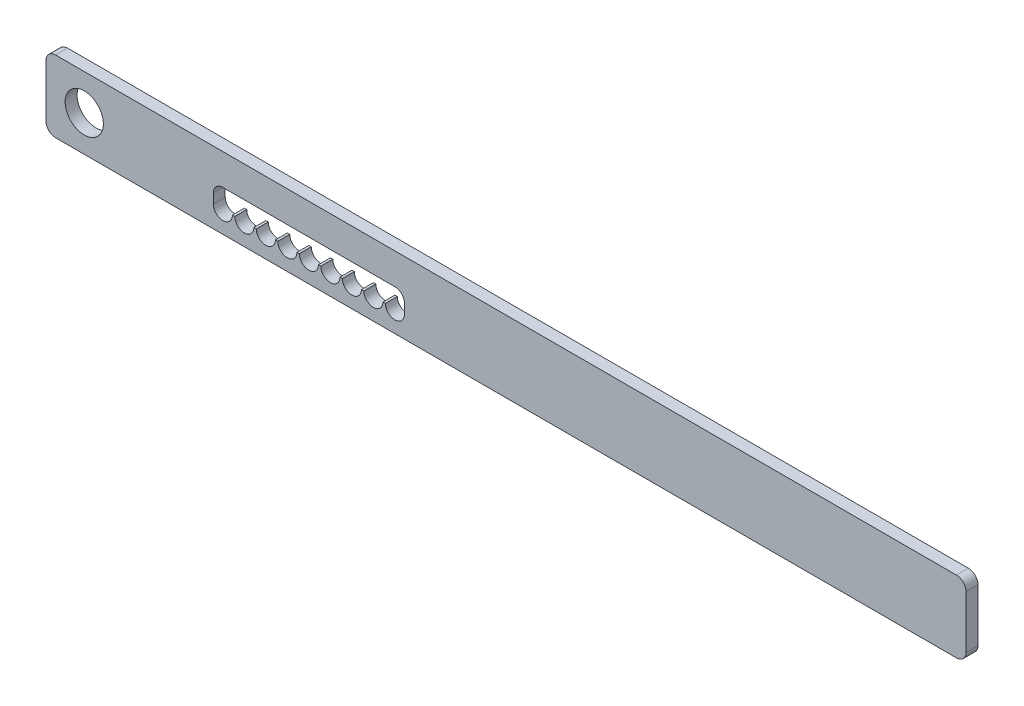
ISO-10303-21;
HEADER;
FILE_DESCRIPTION(('STEP AP214'),'2;1');
FILE_NAME('part.step','',(''),(''),'','','');
FILE_SCHEMA(('AUTOMOTIVE_DESIGN { 1 0 10303 214 1 1 1 1 }'));
ENDSEC;
DATA;
#1=APPLICATION_CONTEXT('core data for automotive mechanical design processes');
#2=APPLICATION_PROTOCOL_DEFINITION('international standard','automotive_design',2000,#1);
#3=PRODUCT_CONTEXT('',#1,'mechanical');
#4=PRODUCT('Part','Part','',(#3));
#5=PRODUCT_RELATED_PRODUCT_CATEGORY('part','',(#4));
#6=PRODUCT_DEFINITION_FORMATION('','',#4);
#7=PRODUCT_DEFINITION_CONTEXT('part definition',#1,'design');
#8=PRODUCT_DEFINITION('design','',#6,#7);
#9=PRODUCT_DEFINITION_SHAPE('','',#8);
#10=(LENGTH_UNIT() NAMED_UNIT(*) SI_UNIT(.MILLI.,.METRE.));
#11=(NAMED_UNIT(*) PLANE_ANGLE_UNIT() SI_UNIT($,.RADIAN.));
#12=(NAMED_UNIT(*) SI_UNIT($,.STERADIAN.) SOLID_ANGLE_UNIT());
#13=UNCERTAINTY_MEASURE_WITH_UNIT(LENGTH_MEASURE(1.E-05),#10,'distance_accuracy_value','');
#14=(GEOMETRIC_REPRESENTATION_CONTEXT(3) GLOBAL_UNCERTAINTY_ASSIGNED_CONTEXT((#13)) GLOBAL_UNIT_ASSIGNED_CONTEXT((#10,
#11,#12)) REPRESENTATION_CONTEXT('',''));
#15=CARTESIAN_POINT('',(0.,0.,0.));
#16=DIRECTION('',(0.,0.,1.));
#17=DIRECTION('',(1.,0.,0.));
#18=AXIS2_PLACEMENT_3D('',#15,#16,#17);
#19=CARTESIAN_POINT('',(-122.5,-6.,-7.5));
#20=DIRECTION('',(0.,-1.,0.));
#21=DIRECTION('',(0.,0.,-1.));
#22=AXIS2_PLACEMENT_3D('',#19,#20,#21);
#23=PLANE('',#22);
#24=DIRECTION('',(1.,0.,0.));
#25=VECTOR('',#24,1.);
#26=CARTESIAN_POINT('',(192.5,-6.,-2.5));
#27=LINE('',#26,#25);
#28=CARTESIAN_POINT('',(-105.5,-6.,-2.5));
#29=VERTEX_POINT('',#28);
#30=CARTESIAN_POINT('',(-104.5,-6.,-2.5));
#31=VERTEX_POINT('',#30);
#32=EDGE_CURVE('E305',#29,#31,#27,.T.);
#33=ORIENTED_EDGE('',*,*,#32,.F.);
#34=DIRECTION('',(0.,0.,1.));
#35=VECTOR('',#34,1.);
#36=CARTESIAN_POINT('',(-105.5,-6.,-7.5));
#37=LINE('',#36,#35);
#38=CARTESIAN_POINT('',(-105.5,-6.,2.5));
#39=VERTEX_POINT('',#38);
#40=EDGE_CURVE('E393',#29,#39,#37,.T.);
#41=ORIENTED_EDGE('',*,*,#40,.T.);
#42=DIRECTION('',(1.,0.,0.));
#43=VECTOR('',#42,1.);
#44=CARTESIAN_POINT('',(-122.5,-6.,2.5));
#45=LINE('',#44,#43);
#46=CARTESIAN_POINT('',(-104.5,-6.,2.5));
#47=VERTEX_POINT('',#46);
#48=EDGE_CURVE('E293',#39,#47,#45,.T.);
#49=ORIENTED_EDGE('',*,*,#48,.T.);
#50=DIRECTION('',(0.,0.,1.));
#51=VECTOR('',#50,1.);
#52=CARTESIAN_POINT('',(-104.5,-6.,-7.5));
#53=LINE('',#52,#51);
#54=EDGE_CURVE('E384',#47,#31,#53,.F.);
#55=ORIENTED_EDGE('',*,*,#54,.T.);
#56=EDGE_LOOP('',(#33,#41,#49,#55));
#57=FACE_BOUND('',#56,.T.);
#58=ADVANCED_FACE('F51',(#57),#23,.F.);
#59=CARTESIAN_POINT('',(-96.5,-6.,-2.5));
#60=VERTEX_POINT('',#59);
#61=CARTESIAN_POINT('',(-95.5,-6.,-2.5));
#62=VERTEX_POINT('',#61);
#63=EDGE_CURVE('E517',#60,#62,#27,.T.);
#64=ORIENTED_EDGE('',*,*,#63,.F.);
#65=DIRECTION('',(0.,0.,1.));
#66=VECTOR('',#65,1.);
#67=CARTESIAN_POINT('',(-96.5,-6.,-7.5));
#68=LINE('',#67,#66);
#69=CARTESIAN_POINT('',(-96.5,-6.,2.5));
#70=VERTEX_POINT('',#69);
#71=EDGE_CURVE('E387',#60,#70,#68,.T.);
#72=ORIENTED_EDGE('',*,*,#71,.T.);
#73=CARTESIAN_POINT('',(-95.5,-6.,2.5));
#74=VERTEX_POINT('',#73);
#75=EDGE_CURVE('E537',#70,#74,#45,.T.);
#76=ORIENTED_EDGE('',*,*,#75,.T.);
#77=DIRECTION('',(0.,0.,1.));
#78=VECTOR('',#77,1.);
#79=CARTESIAN_POINT('',(-95.5,-6.,-7.5));
#80=LINE('',#79,#78);
#81=EDGE_CURVE('E378',#74,#62,#80,.F.);
#82=ORIENTED_EDGE('',*,*,#81,.T.);
#83=EDGE_LOOP('',(#64,#72,#76,#82));
#84=FACE_BOUND('',#83,.T.);
#85=ADVANCED_FACE('F465',(#84),#23,.F.);
#86=CARTESIAN_POINT('',(-87.5,-6.,-2.5));
#87=VERTEX_POINT('',#86);
#88=CARTESIAN_POINT('',(-86.5,-6.,-2.5));
#89=VERTEX_POINT('',#88);
#90=EDGE_CURVE('E513',#87,#89,#27,.T.);
#91=ORIENTED_EDGE('',*,*,#90,.F.);
#92=DIRECTION('',(0.,0.,1.));
#93=VECTOR('',#92,1.);
#94=CARTESIAN_POINT('',(-87.5,-6.,-7.5));
#95=LINE('',#94,#93);
#96=CARTESIAN_POINT('',(-87.5,-6.,2.5));
#97=VERTEX_POINT('',#96);
#98=EDGE_CURVE('E381',#87,#97,#95,.T.);
#99=ORIENTED_EDGE('',*,*,#98,.T.);
#100=CARTESIAN_POINT('',(-86.5,-6.,2.5));
#101=VERTEX_POINT('',#100);
#102=EDGE_CURVE('E848',#97,#101,#45,.T.);
#103=ORIENTED_EDGE('',*,*,#102,.T.);
#104=DIRECTION('',(0.,0.,1.));
#105=VECTOR('',#104,1.);
#106=CARTESIAN_POINT('',(-86.5,-6.,-7.5));
#107=LINE('',#106,#105);
#108=EDGE_CURVE('E372',#101,#89,#107,.F.);
#109=ORIENTED_EDGE('',*,*,#108,.T.);
#110=EDGE_LOOP('',(#91,#99,#103,#109));
#111=FACE_BOUND('',#110,.T.);
#112=ADVANCED_FACE('F472',(#111),#23,.F.);
#113=CARTESIAN_POINT('',(-78.5,-6.,-2.5));
#114=VERTEX_POINT('',#113);
#115=CARTESIAN_POINT('',(-77.5,-6.,-2.5));
#116=VERTEX_POINT('',#115);
#117=EDGE_CURVE('E509',#114,#116,#27,.T.);
#118=ORIENTED_EDGE('',*,*,#117,.F.);
#119=DIRECTION('',(0.,0.,1.));
#120=VECTOR('',#119,1.);
#121=CARTESIAN_POINT('',(-78.5,-6.,-7.5));
#122=LINE('',#121,#120);
#123=CARTESIAN_POINT('',(-78.5,-6.,2.5));
#124=VERTEX_POINT('',#123);
#125=EDGE_CURVE('E375',#114,#124,#122,.T.);
#126=ORIENTED_EDGE('',*,*,#125,.T.);
#127=CARTESIAN_POINT('',(-77.5,-6.,2.5));
#128=VERTEX_POINT('',#127);
#129=EDGE_CURVE('E853',#124,#128,#45,.T.);
#130=ORIENTED_EDGE('',*,*,#129,.T.);
#131=DIRECTION('',(0.,0.,1.));
#132=VECTOR('',#131,1.);
#133=CARTESIAN_POINT('',(-77.5,-6.,-7.5));
#134=LINE('',#133,#132);
#135=EDGE_CURVE('E366',#128,#116,#134,.F.);
#136=ORIENTED_EDGE('',*,*,#135,.T.);
#137=EDGE_LOOP('',(#118,#126,#130,#136));
#138=FACE_BOUND('',#137,.T.);
#139=ADVANCED_FACE('F817',(#138),#23,.F.);
#140=CARTESIAN_POINT('',(-69.5,-6.,-2.5));
#141=VERTEX_POINT('',#140);
#142=CARTESIAN_POINT('',(-68.5,-6.,-2.5));
#143=VERTEX_POINT('',#142);
#144=EDGE_CURVE('E505',#141,#143,#27,.T.);
#145=ORIENTED_EDGE('',*,*,#144,.F.);
#146=DIRECTION('',(0.,0.,1.));
#147=VECTOR('',#146,1.);
#148=CARTESIAN_POINT('',(-69.5,-6.,-7.5));
#149=LINE('',#148,#147);
#150=CARTESIAN_POINT('',(-69.5,-6.,2.5));
#151=VERTEX_POINT('',#150);
#152=EDGE_CURVE('E369',#141,#151,#149,.T.);
#153=ORIENTED_EDGE('',*,*,#152,.T.);
#154=CARTESIAN_POINT('',(-68.5,-6.,2.5));
#155=VERTEX_POINT('',#154);
#156=EDGE_CURVE('E855',#151,#155,#45,.T.);
#157=ORIENTED_EDGE('',*,*,#156,.T.);
#158=DIRECTION('',(0.,0.,1.));
#159=VECTOR('',#158,1.);
#160=CARTESIAN_POINT('',(-68.5,-6.,-7.5));
#161=LINE('',#160,#159);
#162=EDGE_CURVE('E360',#155,#143,#161,.F.);
#163=ORIENTED_EDGE('',*,*,#162,.T.);
#164=EDGE_LOOP('',(#145,#153,#157,#163));
#165=FACE_BOUND('',#164,.T.);
#166=ADVANCED_FACE('F497',(#165),#23,.F.);
#167=CARTESIAN_POINT('',(-60.5,-6.,-2.5));
#168=VERTEX_POINT('',#167);
#169=CARTESIAN_POINT('',(-59.5,-6.,-2.5));
#170=VERTEX_POINT('',#169);
#171=EDGE_CURVE('E503',#168,#170,#27,.T.);
#172=ORIENTED_EDGE('',*,*,#171,.F.);
#173=DIRECTION('',(0.,0.,1.));
#174=VECTOR('',#173,1.);
#175=CARTESIAN_POINT('',(-60.5,-6.,-7.5));
#176=LINE('',#175,#174);
#177=CARTESIAN_POINT('',(-60.5,-6.,2.5));
#178=VERTEX_POINT('',#177);
#179=EDGE_CURVE('E363',#168,#178,#176,.T.);
#180=ORIENTED_EDGE('',*,*,#179,.T.);
#181=CARTESIAN_POINT('',(-59.5,-6.,2.5));
#182=VERTEX_POINT('',#181);
#183=EDGE_CURVE('E857',#178,#182,#45,.T.);
#184=ORIENTED_EDGE('',*,*,#183,.T.);
#185=DIRECTION('',(0.,0.,1.));
#186=VECTOR('',#185,1.);
#187=CARTESIAN_POINT('',(-59.5,-6.,-7.5));
#188=LINE('',#187,#186);
#189=EDGE_CURVE('E354',#182,#170,#188,.F.);
#190=ORIENTED_EDGE('',*,*,#189,.T.);
#191=EDGE_LOOP('',(#172,#180,#184,#190));
#192=FACE_BOUND('',#191,.T.);
#193=ADVANCED_FACE('F490',(#192),#23,.F.);
#194=CARTESIAN_POINT('',(-51.5,-6.,-2.5));
#195=VERTEX_POINT('',#194);
#196=CARTESIAN_POINT('',(-50.5,-6.,-2.5));
#197=VERTEX_POINT('',#196);
#198=EDGE_CURVE('E301',#195,#197,#27,.T.);
#199=ORIENTED_EDGE('',*,*,#198,.F.);
#200=DIRECTION('',(0.,0.,1.));
#201=VECTOR('',#200,1.);
#202=CARTESIAN_POINT('',(-51.5,-6.,-7.5));
#203=LINE('',#202,#201);
#204=CARTESIAN_POINT('',(-51.5,-6.,2.5));
#205=VERTEX_POINT('',#204);
#206=EDGE_CURVE('E357',#195,#205,#203,.T.);
#207=ORIENTED_EDGE('',*,*,#206,.T.);
#208=CARTESIAN_POINT('',(-50.5,-6.,2.5));
#209=VERTEX_POINT('',#208);
#210=EDGE_CURVE('E290',#205,#209,#45,.T.);
#211=ORIENTED_EDGE('',*,*,#210,.T.);
#212=DIRECTION('',(0.,0.,1.));
#213=VECTOR('',#212,1.);
#214=CARTESIAN_POINT('',(-50.5,-6.,-7.5));
#215=LINE('',#214,#213);
#216=EDGE_CURVE('E254',#209,#197,#215,.F.);
#217=ORIENTED_EDGE('',*,*,#216,.T.);
#218=EDGE_LOOP('',(#199,#207,#211,#217));
#219=FACE_BOUND('',#218,.T.);
#220=ADVANCED_FACE('F480',(#219),#23,.F.);
#221=CARTESIAN_POINT('',(192.5,-15.,2.5));
#222=DIRECTION('',(0.,1.,0.));
#223=DIRECTION('',(0.,0.,1.));
#224=AXIS2_PLACEMENT_3D('',#221,#222,#223);
#225=PLANE('',#224);
#226=DIRECTION('',(-1.,0.,0.));
#227=VECTOR('',#226,1.);
#228=CARTESIAN_POINT('',(192.5,-15.,-2.5));
#229=LINE('',#228,#227);
#230=CARTESIAN_POINT('',(188.5,-15.,-2.5));
#231=VERTEX_POINT('',#230);
#232=CARTESIAN_POINT('',(-188.5,-15.,-2.5));
#233=VERTEX_POINT('',#232);
#234=EDGE_CURVE('E333',#231,#233,#229,.T.);
#235=ORIENTED_EDGE('',*,*,#234,.F.);
#236=DIRECTION('',(0.,0.,-1.));
#237=VECTOR('',#236,1.);
#238=CARTESIAN_POINT('',(188.5,-15.,2.5));
#239=LINE('',#238,#237);
#240=CARTESIAN_POINT('',(188.5,-15.,2.5));
#241=VERTEX_POINT('',#240);
#242=EDGE_CURVE('E413',#231,#241,#239,.F.);
#243=ORIENTED_EDGE('',*,*,#242,.T.);
#244=DIRECTION('',(-1.,0.,0.));
#245=VECTOR('',#244,1.);
#246=CARTESIAN_POINT('',(192.5,-15.,2.5));
#247=LINE('',#246,#245);
#248=CARTESIAN_POINT('',(-188.5,-15.,2.5));
#249=VERTEX_POINT('',#248);
#250=EDGE_CURVE('E321',#241,#249,#247,.T.);
#251=ORIENTED_EDGE('',*,*,#250,.T.);
#252=DIRECTION('',(0.,0.,-1.));
#253=VECTOR('',#252,1.);
#254=CARTESIAN_POINT('',(-188.5,-15.,2.5));
#255=LINE('',#254,#253);
#256=EDGE_CURVE('E410',#249,#233,#255,.T.);
#257=ORIENTED_EDGE('',*,*,#256,.T.);
#258=EDGE_LOOP('',(#235,#243,#251,#257));
#259=FACE_BOUND('',#258,.T.);
#260=ADVANCED_FACE('F444',(#259),#225,.F.);
#261=CARTESIAN_POINT('',(192.5,-15.,-2.5));
#262=DIRECTION('',(0.,0.,1.));
#263=DIRECTION('',(1.,0.,0.));
#264=AXIS2_PLACEMENT_3D('',#261,#262,#263);
#265=PLANE('',#264);
#266=CARTESIAN_POINT('',(-114.5,-6.,-2.5));
#267=VERTEX_POINT('',#266);
#268=CARTESIAN_POINT('',(-113.5,-6.,-2.5));
#269=VERTEX_POINT('',#268);
#270=EDGE_CURVE('E302',#267,#269,#27,.T.);
#271=ORIENTED_EDGE('',*,*,#270,.T.);
#272=CARTESIAN_POINT('',(-109.5,-6.,-2.5));
#273=DIRECTION('',(0.,0.,1.));
#274=DIRECTION('',(1.,0.,0.));
#275=AXIS2_PLACEMENT_3D('',#272,#273,#274);
#276=CIRCLE('',#275,4.00000000000001);
#277=EDGE_CURVE('E527',#269,#29,#276,.T.);
#278=ORIENTED_EDGE('',*,*,#277,.T.);
#279=ORIENTED_EDGE('',*,*,#32,.T.);
#280=CARTESIAN_POINT('',(-100.5,-6.,-2.5));
#281=DIRECTION('',(0.,0.,1.));
#282=DIRECTION('',(1.,0.,0.));
#283=AXIS2_PLACEMENT_3D('',#280,#281,#282);
#284=CIRCLE('',#283,4.00000000000001);
#285=EDGE_CURVE('E526',#31,#60,#284,.T.);
#286=ORIENTED_EDGE('',*,*,#285,.T.);
#287=ORIENTED_EDGE('',*,*,#63,.T.);
#288=CARTESIAN_POINT('',(-91.5,-6.,-2.5));
#289=DIRECTION('',(0.,0.,1.));
#290=DIRECTION('',(1.,0.,0.));
#291=AXIS2_PLACEMENT_3D('',#288,#289,#290);
#292=CIRCLE('',#291,4.00000000000001);
#293=EDGE_CURVE('E561',#62,#87,#292,.T.);
#294=ORIENTED_EDGE('',*,*,#293,.T.);
#295=ORIENTED_EDGE('',*,*,#90,.T.);
#296=CARTESIAN_POINT('',(-82.5,-6.,-2.5));
#297=DIRECTION('',(0.,0.,1.));
#298=DIRECTION('',(1.,0.,0.));
#299=AXIS2_PLACEMENT_3D('',#296,#297,#298);
#300=CIRCLE('',#299,4.00000000000001);
#301=EDGE_CURVE('E559',#89,#114,#300,.T.);
#302=ORIENTED_EDGE('',*,*,#301,.T.);
#303=ORIENTED_EDGE('',*,*,#117,.T.);
#304=CARTESIAN_POINT('',(-73.5,-6.,-2.5));
#305=DIRECTION('',(0.,0.,1.));
#306=DIRECTION('',(1.,0.,0.));
#307=AXIS2_PLACEMENT_3D('',#304,#305,#306);
#308=CIRCLE('',#307,4.00000000000001);
#309=EDGE_CURVE('E557',#116,#141,#308,.T.);
#310=ORIENTED_EDGE('',*,*,#309,.T.);
#311=ORIENTED_EDGE('',*,*,#144,.T.);
#312=CARTESIAN_POINT('',(-64.5,-6.,-2.5));
#313=DIRECTION('',(0.,0.,1.));
#314=DIRECTION('',(1.,0.,0.));
#315=AXIS2_PLACEMENT_3D('',#312,#313,#314);
#316=CIRCLE('',#315,4.00000000000001);
#317=EDGE_CURVE('E555',#143,#168,#316,.T.);
#318=ORIENTED_EDGE('',*,*,#317,.T.);
#319=ORIENTED_EDGE('',*,*,#171,.T.);
#320=CARTESIAN_POINT('',(-55.5,-6.,-2.5));
#321=DIRECTION('',(0.,0.,1.));
#322=DIRECTION('',(1.,0.,0.));
#323=AXIS2_PLACEMENT_3D('',#320,#321,#322);
#324=CIRCLE('',#323,4.00000000000001);
#325=EDGE_CURVE('E553',#170,#195,#324,.T.);
#326=ORIENTED_EDGE('',*,*,#325,.T.);
#327=ORIENTED_EDGE('',*,*,#198,.T.);
#328=CARTESIAN_POINT('',(-46.5,-6.,-2.5));
#329=DIRECTION('',(0.,0.,1.));
#330=DIRECTION('',(1.,0.,0.));
#331=AXIS2_PLACEMENT_3D('',#328,#329,#330);
#332=CIRCLE('',#331,4.00000000000001);
#333=CARTESIAN_POINT('',(-42.5,-6.,-2.5));
#334=VERTEX_POINT('',#333);
#335=EDGE_CURVE('E541',#197,#334,#332,.T.);
#336=ORIENTED_EDGE('',*,*,#335,.T.);
#337=DIRECTION('',(0.,1.,0.));
#338=VECTOR('',#337,1.);
#339=CARTESIAN_POINT('',(-42.5,-15.,-2.5));
#340=LINE('',#339,#338);
#341=CARTESIAN_POINT('',(-42.5,-2.,-2.5));
#342=VERTEX_POINT('',#341);
#343=EDGE_CURVE('E268',#334,#342,#340,.T.);
#344=ORIENTED_EDGE('',*,*,#343,.T.);
#345=CARTESIAN_POINT('',(-46.5,-2.,-2.5));
#346=DIRECTION('',(0.,0.,1.));
#347=DIRECTION('',(1.,0.,0.));
#348=AXIS2_PLACEMENT_3D('',#345,#346,#347);
#349=CIRCLE('',#348,4.);
#350=CARTESIAN_POINT('',(-46.5,2.,-2.5));
#351=VERTEX_POINT('',#350);
#352=EDGE_CURVE('E347',#342,#351,#349,.T.);
#353=ORIENTED_EDGE('',*,*,#352,.T.);
#354=DIRECTION('',(-1.,0.,0.));
#355=VECTOR('',#354,1.);
#356=CARTESIAN_POINT('',(192.5,2.,-2.5));
#357=LINE('',#356,#355);
#358=CARTESIAN_POINT('',(-118.5,2.,-2.5));
#359=VERTEX_POINT('',#358);
#360=EDGE_CURVE('E269',#351,#359,#357,.T.);
#361=ORIENTED_EDGE('',*,*,#360,.T.);
#362=CARTESIAN_POINT('',(-118.5,-2.,-2.5));
#363=DIRECTION('',(0.,0.,1.));
#364=DIRECTION('',(1.,0.,0.));
#365=AXIS2_PLACEMENT_3D('',#362,#363,#364);
#366=CIRCLE('',#365,4.);
#367=CARTESIAN_POINT('',(-122.5,-2.,-2.5));
#368=VERTEX_POINT('',#367);
#369=EDGE_CURVE('E351',#359,#368,#366,.T.);
#370=ORIENTED_EDGE('',*,*,#369,.T.);
#371=DIRECTION('',(0.,-1.,0.));
#372=VECTOR('',#371,1.);
#373=CARTESIAN_POINT('',(-122.5,-15.,-2.5));
#374=LINE('',#373,#372);
#375=CARTESIAN_POINT('',(-122.5,-6.,-2.5));
#376=VERTEX_POINT('',#375);
#377=EDGE_CURVE('E298',#368,#376,#374,.T.);
#378=ORIENTED_EDGE('',*,*,#377,.T.);
#379=CARTESIAN_POINT('',(-118.5,-6.,-2.5));
#380=DIRECTION('',(0.,0.,1.));
#381=DIRECTION('',(1.,0.,0.));
#382=AXIS2_PLACEMENT_3D('',#379,#380,#381);
#383=CIRCLE('',#382,4.00000000000001);
#384=EDGE_CURVE('E284',#376,#267,#383,.T.);
#385=ORIENTED_EDGE('',*,*,#384,.T.);
#386=EDGE_LOOP('',(#271,#278,#279,#286,#287,#294,#295,#302,#303,#310,#311,#318,#319,#326,#327,
#336,#344,#353,#361,#370,#378,#385));
#387=FACE_BOUND('',#386,.T.);
#388=CARTESIAN_POINT('',(-176.5,0.,-2.5));
#389=DIRECTION('',(0.,0.,1.));
#390=DIRECTION('',(1.,0.,0.));
#391=AXIS2_PLACEMENT_3D('',#388,#389,#390);
#392=CIRCLE('',#391,8.00000000000001);
#393=CARTESIAN_POINT('',(-168.5,0.,-2.5));
#394=VERTEX_POINT('',#393);
#395=EDGE_CURVE('E310',#394,#394,#392,.T.);
#396=ORIENTED_EDGE('',*,*,#395,.T.);
#397=EDGE_LOOP('',(#396));
#398=FACE_BOUND('',#397,.T.);
#399=DIRECTION('',(0.,1.,0.));
#400=VECTOR('',#399,1.);
#401=CARTESIAN_POINT('',(192.5,-15.,-2.5));
#402=LINE('',#401,#400);
#403=CARTESIAN_POINT('',(192.5,-11.,-2.5));
#404=VERTEX_POINT('',#403);
#405=CARTESIAN_POINT('',(192.5,11.,-2.5));
#406=VERTEX_POINT('',#405);
#407=EDGE_CURVE('E314',#404,#406,#402,.T.);
#408=ORIENTED_EDGE('',*,*,#407,.F.);
#409=CARTESIAN_POINT('',(188.5,-11.,-2.5));
#410=DIRECTION('',(0.,0.,1.));
#411=DIRECTION('',(1.,0.,0.));
#412=AXIS2_PLACEMENT_3D('',#409,#410,#411);
#413=CIRCLE('',#412,4.);
#414=EDGE_CURVE('E408',#404,#231,#413,.F.);
#415=ORIENTED_EDGE('',*,*,#414,.T.);
#416=ORIENTED_EDGE('',*,*,#234,.T.);
#417=CARTESIAN_POINT('',(-188.5,-11.,-2.5));
#418=DIRECTION('',(0.,0.,1.));
#419=DIRECTION('',(1.,0.,0.));
#420=AXIS2_PLACEMENT_3D('',#417,#418,#419);
#421=CIRCLE('',#420,4.);
#422=CARTESIAN_POINT('',(-192.5,-11.,-2.5));
#423=VERTEX_POINT('',#422);
#424=EDGE_CURVE('E404',#233,#423,#421,.F.);
#425=ORIENTED_EDGE('',*,*,#424,.T.);
#426=DIRECTION('',(0.,1.,0.));
#427=VECTOR('',#426,1.);
#428=CARTESIAN_POINT('',(-192.5,-15.,-2.5));
#429=LINE('',#428,#427);
#430=CARTESIAN_POINT('',(-192.5,11.,-2.5));
#431=VERTEX_POINT('',#430);
#432=EDGE_CURVE('E313',#423,#431,#429,.T.);
#433=ORIENTED_EDGE('',*,*,#432,.T.);
#434=CARTESIAN_POINT('',(-188.5,11.,-2.5));
#435=DIRECTION('',(0.,0.,1.));
#436=DIRECTION('',(1.,0.,0.));
#437=AXIS2_PLACEMENT_3D('',#434,#435,#436);
#438=CIRCLE('',#437,4.);
#439=CARTESIAN_POINT('',(-188.5,15.,-2.5));
#440=VERTEX_POINT('',#439);
#441=EDGE_CURVE('E402',#431,#440,#438,.F.);
#442=ORIENTED_EDGE('',*,*,#441,.T.);
#443=DIRECTION('',(-1.,0.,0.));
#444=VECTOR('',#443,1.);
#445=CARTESIAN_POINT('',(192.5,15.,-2.5));
#446=LINE('',#445,#444);
#447=CARTESIAN_POINT('',(188.5,15.,-2.5));
#448=VERTEX_POINT('',#447);
#449=EDGE_CURVE('E330',#448,#440,#446,.T.);
#450=ORIENTED_EDGE('',*,*,#449,.F.);
#451=CARTESIAN_POINT('',(188.5,11.,-2.5));
#452=DIRECTION('',(0.,0.,1.));
#453=DIRECTION('',(1.,0.,0.));
#454=AXIS2_PLACEMENT_3D('',#451,#452,#453);
#455=CIRCLE('',#454,4.);
#456=EDGE_CURVE('E406',#448,#406,#455,.F.);
#457=ORIENTED_EDGE('',*,*,#456,.T.);
#458=EDGE_LOOP('',(#408,#415,#416,#425,#433,#442,#450,#457));
#459=FACE_BOUND('',#458,.T.);
#460=ADVANCED_FACE('F432',(#387,#398,#459),#265,.F.);
#461=CARTESIAN_POINT('',(192.5,15.,2.5));
#462=DIRECTION('',(0.,-1.,0.));
#463=DIRECTION('',(0.,0.,-1.));
#464=AXIS2_PLACEMENT_3D('',#461,#462,#463);
#465=PLANE('',#464);
#466=DIRECTION('',(-1.,0.,0.));
#467=VECTOR('',#466,1.);
#468=CARTESIAN_POINT('',(192.5,15.,2.5));
#469=LINE('',#468,#467);
#470=CARTESIAN_POINT('',(188.5,15.,2.5));
#471=VERTEX_POINT('',#470);
#472=CARTESIAN_POINT('',(-188.5,15.,2.5));
#473=VERTEX_POINT('',#472);
#474=EDGE_CURVE('E328',#471,#473,#469,.T.);
#475=ORIENTED_EDGE('',*,*,#474,.F.);
#476=DIRECTION('',(0.,0.,1.));
#477=VECTOR('',#476,1.);
#478=CARTESIAN_POINT('',(188.5,15.,-2.5));
#479=LINE('',#478,#477);
#480=EDGE_CURVE('E423',#471,#448,#479,.F.);
#481=ORIENTED_EDGE('',*,*,#480,.T.);
#482=ORIENTED_EDGE('',*,*,#449,.T.);
#483=DIRECTION('',(0.,0.,1.));
#484=VECTOR('',#483,1.);
#485=CARTESIAN_POINT('',(-188.5,15.,2.5));
#486=LINE('',#485,#484);
#487=EDGE_CURVE('E421',#440,#473,#486,.T.);
#488=ORIENTED_EDGE('',*,*,#487,.T.);
#489=EDGE_LOOP('',(#475,#481,#482,#488));
#490=FACE_BOUND('',#489,.T.);
#491=ADVANCED_FACE('F435',(#490),#465,.F.);
#492=CARTESIAN_POINT('',(192.5,-15.,2.5));
#493=DIRECTION('',(0.,0.,-1.));
#494=DIRECTION('',(-1.,0.,0.));
#495=AXIS2_PLACEMENT_3D('',#492,#493,#494);
#496=PLANE('',#495);
#497=ORIENTED_EDGE('',*,*,#48,.F.);
#498=CARTESIAN_POINT('',(-109.5,-6.,2.5));
#499=DIRECTION('',(0.,0.,1.));
#500=DIRECTION('',(1.,0.,0.));
#501=AXIS2_PLACEMENT_3D('',#498,#499,#500);
#502=CIRCLE('',#501,4.00000000000001);
#503=CARTESIAN_POINT('',(-113.5,-6.,2.5));
#504=VERTEX_POINT('',#503);
#505=EDGE_CURVE('E538',#504,#39,#502,.T.);
#506=ORIENTED_EDGE('',*,*,#505,.F.);
#507=CARTESIAN_POINT('',(-114.5,-6.,2.5));
#508=VERTEX_POINT('',#507);
#509=EDGE_CURVE('E291',#508,#504,#45,.T.);
#510=ORIENTED_EDGE('',*,*,#509,.F.);
#511=CARTESIAN_POINT('',(-118.5,-6.,2.5));
#512=DIRECTION('',(0.,0.,1.));
#513=DIRECTION('',(1.,0.,0.));
#514=AXIS2_PLACEMENT_3D('',#511,#512,#513);
#515=CIRCLE('',#514,4.00000000000001);
#516=CARTESIAN_POINT('',(-122.5,-6.,2.5));
#517=VERTEX_POINT('',#516);
#518=EDGE_CURVE('E565',#517,#508,#515,.T.);
#519=ORIENTED_EDGE('',*,*,#518,.F.);
#520=DIRECTION('',(0.,-1.,0.));
#521=VECTOR('',#520,1.);
#522=CARTESIAN_POINT('',(-122.5,2.,2.5));
#523=LINE('',#522,#521);
#524=CARTESIAN_POINT('',(-122.5,-2.,2.5));
#525=VERTEX_POINT('',#524);
#526=EDGE_CURVE('E281',#525,#517,#523,.T.);
#527=ORIENTED_EDGE('',*,*,#526,.F.);
#528=CARTESIAN_POINT('',(-118.5,-2.,2.5));
#529=DIRECTION('',(0.,0.,-1.));
#530=DIRECTION('',(-1.,0.,0.));
#531=AXIS2_PLACEMENT_3D('',#528,#529,#530);
#532=CIRCLE('',#531,4.);
#533=CARTESIAN_POINT('',(-118.5,2.,2.5));
#534=VERTEX_POINT('',#533);
#535=EDGE_CURVE('E349',#525,#534,#532,.T.);
#536=ORIENTED_EDGE('',*,*,#535,.T.);
#537=DIRECTION('',(-1.,0.,0.));
#538=VECTOR('',#537,1.);
#539=CARTESIAN_POINT('',(-122.5,2.,2.5));
#540=LINE('',#539,#538);
#541=CARTESIAN_POINT('',(-46.5,2.,2.5));
#542=VERTEX_POINT('',#541);
#543=EDGE_CURVE('E277',#542,#534,#540,.T.);
#544=ORIENTED_EDGE('',*,*,#543,.F.);
#545=CARTESIAN_POINT('',(-46.5,-2.,2.5));
#546=DIRECTION('',(0.,0.,-1.));
#547=DIRECTION('',(-1.,0.,0.));
#548=AXIS2_PLACEMENT_3D('',#545,#546,#547);
#549=CIRCLE('',#548,4.);
#550=CARTESIAN_POINT('',(-42.5,-2.,2.5));
#551=VERTEX_POINT('',#550);
#552=EDGE_CURVE('E276',#542,#551,#549,.T.);
#553=ORIENTED_EDGE('',*,*,#552,.T.);
#554=DIRECTION('',(0.,1.,0.));
#555=VECTOR('',#554,1.);
#556=CARTESIAN_POINT('',(-42.5,2.,2.5));
#557=LINE('',#556,#555);
#558=CARTESIAN_POINT('',(-42.5,-6.,2.5));
#559=VERTEX_POINT('',#558);
#560=EDGE_CURVE('E265',#559,#551,#557,.T.);
#561=ORIENTED_EDGE('',*,*,#560,.F.);
#562=CARTESIAN_POINT('',(-46.5,-6.,2.5));
#563=DIRECTION('',(0.,0.,1.));
#564=DIRECTION('',(1.,0.,0.));
#565=AXIS2_PLACEMENT_3D('',#562,#563,#564);
#566=CIRCLE('',#565,4.00000000000001);
#567=EDGE_CURVE('E248',#209,#559,#566,.T.);
#568=ORIENTED_EDGE('',*,*,#567,.F.);
#569=ORIENTED_EDGE('',*,*,#210,.F.);
#570=CARTESIAN_POINT('',(-55.5,-6.,2.5));
#571=DIRECTION('',(0.,0.,1.));
#572=DIRECTION('',(1.,0.,0.));
#573=AXIS2_PLACEMENT_3D('',#570,#571,#572);
#574=CIRCLE('',#573,4.00000000000001);
#575=EDGE_CURVE('E259',#182,#205,#574,.T.);
#576=ORIENTED_EDGE('',*,*,#575,.F.);
#577=ORIENTED_EDGE('',*,*,#183,.F.);
#578=CARTESIAN_POINT('',(-64.5,-6.,2.5));
#579=DIRECTION('',(0.,0.,1.));
#580=DIRECTION('',(1.,0.,0.));
#581=AXIS2_PLACEMENT_3D('',#578,#579,#580);
#582=CIRCLE('',#581,4.00000000000001);
#583=EDGE_CURVE('E549',#155,#178,#582,.T.);
#584=ORIENTED_EDGE('',*,*,#583,.F.);
#585=ORIENTED_EDGE('',*,*,#156,.F.);
#586=CARTESIAN_POINT('',(-73.5,-6.,2.5));
#587=DIRECTION('',(0.,0.,1.));
#588=DIRECTION('',(1.,0.,0.));
#589=AXIS2_PLACEMENT_3D('',#586,#587,#588);
#590=CIRCLE('',#589,4.00000000000001);
#591=EDGE_CURVE('E547',#128,#151,#590,.T.);
#592=ORIENTED_EDGE('',*,*,#591,.F.);
#593=ORIENTED_EDGE('',*,*,#129,.F.);
#594=CARTESIAN_POINT('',(-82.5,-6.,2.5));
#595=DIRECTION('',(0.,0.,1.));
#596=DIRECTION('',(1.,0.,0.));
#597=AXIS2_PLACEMENT_3D('',#594,#595,#596);
#598=CIRCLE('',#597,4.00000000000001);
#599=EDGE_CURVE('E543',#101,#124,#598,.T.);
#600=ORIENTED_EDGE('',*,*,#599,.F.);
#601=ORIENTED_EDGE('',*,*,#102,.F.);
#602=CARTESIAN_POINT('',(-91.5,-6.,2.5));
#603=DIRECTION('',(0.,0.,1.));
#604=DIRECTION('',(1.,0.,0.));
#605=AXIS2_PLACEMENT_3D('',#602,#603,#604);
#606=CIRCLE('',#605,4.00000000000001);
#607=EDGE_CURVE('E539',#74,#97,#606,.T.);
#608=ORIENTED_EDGE('',*,*,#607,.F.);
#609=ORIENTED_EDGE('',*,*,#75,.F.);
#610=CARTESIAN_POINT('',(-100.5,-6.,2.5));
#611=DIRECTION('',(0.,0.,1.));
#612=DIRECTION('',(1.,0.,0.));
#613=AXIS2_PLACEMENT_3D('',#610,#611,#612);
#614=CIRCLE('',#613,4.00000000000001);
#615=EDGE_CURVE('E532',#47,#70,#614,.T.);
#616=ORIENTED_EDGE('',*,*,#615,.F.);
#617=EDGE_LOOP('',(#497,#506,#510,#519,#527,#536,#544,#553,#561,#568,#569,#576,#577,#584,#585,
#592,#593,#600,#601,#608,#609,#616));
#618=FACE_BOUND('',#617,.T.);
#619=CARTESIAN_POINT('',(-176.5,0.,2.5));
#620=DIRECTION('',(0.,0.,1.));
#621=DIRECTION('',(1.,0.,0.));
#622=AXIS2_PLACEMENT_3D('',#619,#620,#621);
#623=CIRCLE('',#622,8.00000000000001);
#624=CARTESIAN_POINT('',(-168.5,0.,2.5));
#625=VERTEX_POINT('',#624);
#626=EDGE_CURVE('E307',#625,#625,#623,.T.);
#627=ORIENTED_EDGE('',*,*,#626,.F.);
#628=EDGE_LOOP('',(#627));
#629=FACE_BOUND('',#628,.T.);
#630=ORIENTED_EDGE('',*,*,#250,.F.);
#631=CARTESIAN_POINT('',(188.5,-11.,2.5));
#632=DIRECTION('',(0.,0.,-1.));
#633=DIRECTION('',(-1.,0.,0.));
#634=AXIS2_PLACEMENT_3D('',#631,#632,#633);
#635=CIRCLE('',#634,4.);
#636=CARTESIAN_POINT('',(192.5,-11.,2.5));
#637=VERTEX_POINT('',#636);
#638=EDGE_CURVE('E419',#241,#637,#635,.F.);
#639=ORIENTED_EDGE('',*,*,#638,.T.);
#640=DIRECTION('',(0.,-1.,0.));
#641=VECTOR('',#640,1.);
#642=CARTESIAN_POINT('',(192.5,-15.,2.5));
#643=LINE('',#642,#641);
#644=CARTESIAN_POINT('',(192.5,11.,2.5));
#645=VERTEX_POINT('',#644);
#646=EDGE_CURVE('E317',#645,#637,#643,.T.);
#647=ORIENTED_EDGE('',*,*,#646,.F.);
#648=CARTESIAN_POINT('',(188.5,11.,2.5));
#649=DIRECTION('',(0.,0.,-1.));
#650=DIRECTION('',(-1.,0.,0.));
#651=AXIS2_PLACEMENT_3D('',#648,#649,#650);
#652=CIRCLE('',#651,4.);
#653=EDGE_CURVE('E74',#645,#471,#652,.F.);
#654=ORIENTED_EDGE('',*,*,#653,.T.);
#655=ORIENTED_EDGE('',*,*,#474,.T.);
#656=CARTESIAN_POINT('',(-188.5,11.,2.5));
#657=DIRECTION('',(0.,0.,-1.));
#658=DIRECTION('',(-1.,0.,0.));
#659=AXIS2_PLACEMENT_3D('',#656,#657,#658);
#660=CIRCLE('',#659,4.);
#661=CARTESIAN_POINT('',(-192.5,11.,2.5));
#662=VERTEX_POINT('',#661);
#663=EDGE_CURVE('E66',#473,#662,#660,.F.);
#664=ORIENTED_EDGE('',*,*,#663,.T.);
#665=DIRECTION('',(0.,-1.,0.));
#666=VECTOR('',#665,1.);
#667=CARTESIAN_POINT('',(-192.5,-15.,2.5));
#668=LINE('',#667,#666);
#669=CARTESIAN_POINT('',(-192.5,-11.,2.5));
#670=VERTEX_POINT('',#669);
#671=EDGE_CURVE('E318',#662,#670,#668,.T.);
#672=ORIENTED_EDGE('',*,*,#671,.T.);
#673=CARTESIAN_POINT('',(-188.5,-11.,2.5));
#674=DIRECTION('',(0.,0.,-1.));
#675=DIRECTION('',(-1.,0.,0.));
#676=AXIS2_PLACEMENT_3D('',#673,#674,#675);
#677=CIRCLE('',#676,4.);
#678=EDGE_CURVE('E416',#670,#249,#677,.F.);
#679=ORIENTED_EDGE('',*,*,#678,.T.);
#680=EDGE_LOOP('',(#630,#639,#647,#654,#655,#664,#672,#679));
#681=FACE_BOUND('',#680,.T.);
#682=ADVANCED_FACE('F273',(#618,#629,#681),#496,.F.);
#683=CARTESIAN_POINT('',(192.5,-15.,-2.5));
#684=DIRECTION('',(1.,0.,0.));
#685=DIRECTION('',(0.,0.,-1.));
#686=AXIS2_PLACEMENT_3D('',#683,#684,#685);
#687=PLANE('',#686);
#688=ORIENTED_EDGE('',*,*,#646,.T.);
#689=DIRECTION('',(0.,0.,-1.));
#690=VECTOR('',#689,1.);
#691=CARTESIAN_POINT('',(192.5,-11.,-2.5));
#692=LINE('',#691,#690);
#693=EDGE_CURVE('E399',#637,#404,#692,.T.);
#694=ORIENTED_EDGE('',*,*,#693,.T.);
#695=ORIENTED_EDGE('',*,*,#407,.T.);
#696=DIRECTION('',(0.,0.,1.));
#697=VECTOR('',#696,1.);
#698=CARTESIAN_POINT('',(192.5,11.,2.5));
#699=LINE('',#698,#697);
#700=EDGE_CURVE('E396',#406,#645,#699,.T.);
#701=ORIENTED_EDGE('',*,*,#700,.T.);
#702=EDGE_LOOP('',(#688,#694,#695,#701));
#703=FACE_BOUND('',#702,.T.);
#704=ADVANCED_FACE('F451',(#703),#687,.T.);
#705=CARTESIAN_POINT('',(-192.5,-15.,-2.5));
#706=DIRECTION('',(1.,0.,0.));
#707=DIRECTION('',(0.,0.,-1.));
#708=AXIS2_PLACEMENT_3D('',#705,#706,#707);
#709=PLANE('',#708);
#710=ORIENTED_EDGE('',*,*,#432,.F.);
#711=DIRECTION('',(0.,0.,-1.));
#712=VECTOR('',#711,1.);
#713=CARTESIAN_POINT('',(-192.5,-11.,-2.5));
#714=LINE('',#713,#712);
#715=EDGE_CURVE('E12',#423,#670,#714,.F.);
#716=ORIENTED_EDGE('',*,*,#715,.T.);
#717=ORIENTED_EDGE('',*,*,#671,.F.);
#718=DIRECTION('',(0.,0.,1.));
#719=VECTOR('',#718,1.);
#720=CARTESIAN_POINT('',(-192.5,11.,-2.5));
#721=LINE('',#720,#719);
#722=EDGE_CURVE('E59',#662,#431,#721,.F.);
#723=ORIENTED_EDGE('',*,*,#722,.T.);
#724=EDGE_LOOP('',(#710,#716,#717,#723));
#725=FACE_BOUND('',#724,.T.);
#726=ADVANCED_FACE('F427',(#725),#709,.F.);
#727=CARTESIAN_POINT('',(-176.5,0.,-7.5));
#728=DIRECTION('',(0.,0.,1.));
#729=DIRECTION('',(1.,0.,0.));
#730=AXIS2_PLACEMENT_3D('',#727,#728,#729);
#731=CYLINDRICAL_SURFACE('',#730,8.00000000000001);
#732=ORIENTED_EDGE('',*,*,#626,.T.);
#733=EDGE_LOOP('',(#732));
#734=FACE_BOUND('',#733,.T.);
#735=ORIENTED_EDGE('',*,*,#395,.F.);
#736=EDGE_LOOP('',(#735));
#737=FACE_BOUND('',#736,.T.);
#738=ADVANCED_FACE('F487',(#734,#737),#731,.F.);
#739=CARTESIAN_POINT('',(-42.5,2.,-7.5));
#740=DIRECTION('',(1.,0.,0.));
#741=DIRECTION('',(0.,0.,-1.));
#742=AXIS2_PLACEMENT_3D('',#739,#740,#741);
#743=PLANE('',#742);
#744=ORIENTED_EDGE('',*,*,#560,.T.);
#745=DIRECTION('',(0.,0.,1.));
#746=VECTOR('',#745,1.);
#747=CARTESIAN_POINT('',(-42.5,-2.,-2.5));
#748=LINE('',#747,#746);
#749=EDGE_CURVE('E341',#551,#342,#748,.F.);
#750=ORIENTED_EDGE('',*,*,#749,.T.);
#751=ORIENTED_EDGE('',*,*,#343,.F.);
#752=DIRECTION('',(0.,0.,1.));
#753=VECTOR('',#752,1.);
#754=CARTESIAN_POINT('',(-42.5,-6.,-7.5));
#755=LINE('',#754,#753);
#756=EDGE_CURVE('E251',#334,#559,#755,.T.);
#757=ORIENTED_EDGE('',*,*,#756,.T.);
#758=EDGE_LOOP('',(#744,#750,#751,#757));
#759=FACE_BOUND('',#758,.T.);
#760=ADVANCED_FACE('F264',(#759),#743,.F.);
#761=ORIENTED_EDGE('',*,*,#509,.T.);
#762=DIRECTION('',(0.,0.,1.));
#763=VECTOR('',#762,1.);
#764=CARTESIAN_POINT('',(-113.5,-6.,-7.5));
#765=LINE('',#764,#763);
#766=EDGE_CURVE('E390',#504,#269,#765,.F.);
#767=ORIENTED_EDGE('',*,*,#766,.T.);
#768=ORIENTED_EDGE('',*,*,#270,.F.);
#769=DIRECTION('',(0.,0.,1.));
#770=VECTOR('',#769,1.);
#771=CARTESIAN_POINT('',(-114.5,-6.,-7.5));
#772=LINE('',#771,#770);
#773=EDGE_CURVE('E278',#267,#508,#772,.T.);
#774=ORIENTED_EDGE('',*,*,#773,.T.);
#775=EDGE_LOOP('',(#761,#767,#768,#774));
#776=FACE_BOUND('',#775,.T.);
#777=ADVANCED_FACE('F468',(#776),#23,.F.);
#778=CARTESIAN_POINT('',(-122.5,2.,-7.5));
#779=DIRECTION('',(-1.,0.,0.));
#780=DIRECTION('',(0.,0.,1.));
#781=AXIS2_PLACEMENT_3D('',#778,#779,#780);
#782=PLANE('',#781);
#783=ORIENTED_EDGE('',*,*,#377,.F.);
#784=DIRECTION('',(0.,0.,1.));
#785=VECTOR('',#784,1.);
#786=CARTESIAN_POINT('',(-122.5,-2.,2.5));
#787=LINE('',#786,#785);
#788=EDGE_CURVE('E343',#368,#525,#787,.T.);
#789=ORIENTED_EDGE('',*,*,#788,.T.);
#790=ORIENTED_EDGE('',*,*,#526,.T.);
#791=DIRECTION('',(0.,0.,1.));
#792=VECTOR('',#791,1.);
#793=CARTESIAN_POINT('',(-122.5,-6.,-7.5));
#794=LINE('',#793,#792);
#795=EDGE_CURVE('E270',#376,#517,#794,.T.);
#796=ORIENTED_EDGE('',*,*,#795,.F.);
#797=EDGE_LOOP('',(#783,#789,#790,#796));
#798=FACE_BOUND('',#797,.T.);
#799=ADVANCED_FACE('F478',(#798),#782,.F.);
#800=CARTESIAN_POINT('',(-122.5,2.,-7.5));
#801=DIRECTION('',(0.,1.,0.));
#802=DIRECTION('',(0.,0.,1.));
#803=AXIS2_PLACEMENT_3D('',#800,#801,#802);
#804=PLANE('',#803);
#805=ORIENTED_EDGE('',*,*,#360,.F.);
#806=DIRECTION('',(0.,0.,1.));
#807=VECTOR('',#806,1.);
#808=CARTESIAN_POINT('',(-46.5,2.,2.5));
#809=LINE('',#808,#807);
#810=EDGE_CURVE('E338',#351,#542,#809,.T.);
#811=ORIENTED_EDGE('',*,*,#810,.T.);
#812=ORIENTED_EDGE('',*,*,#543,.T.);
#813=DIRECTION('',(0.,0.,1.));
#814=VECTOR('',#813,1.);
#815=CARTESIAN_POINT('',(-118.5,2.,-2.5));
#816=LINE('',#815,#814);
#817=EDGE_CURVE('E336',#534,#359,#816,.F.);
#818=ORIENTED_EDGE('',*,*,#817,.T.);
#819=EDGE_LOOP('',(#805,#811,#812,#818));
#820=FACE_BOUND('',#819,.T.);
#821=ADVANCED_FACE('F485',(#820),#804,.F.);
#822=CARTESIAN_POINT('',(-46.5,-2.,-7.5));
#823=DIRECTION('',(0.,0.,-1.));
#824=DIRECTION('',(-1.,0.,0.));
#825=AXIS2_PLACEMENT_3D('',#822,#823,#824);
#826=CYLINDRICAL_SURFACE('',#825,4.);
#827=ORIENTED_EDGE('',*,*,#352,.F.);
#828=ORIENTED_EDGE('',*,*,#749,.F.);
#829=ORIENTED_EDGE('',*,*,#552,.F.);
#830=ORIENTED_EDGE('',*,*,#810,.F.);
#831=EDGE_LOOP('',(#827,#828,#829,#830));
#832=FACE_BOUND('',#831,.T.);
#833=ADVANCED_FACE('F585',(#832),#826,.F.);
#834=CARTESIAN_POINT('',(-118.5,-2.,-7.5));
#835=DIRECTION('',(0.,0.,-1.));
#836=DIRECTION('',(-1.,0.,0.));
#837=AXIS2_PLACEMENT_3D('',#834,#835,#836);
#838=CYLINDRICAL_SURFACE('',#837,4.);
#839=ORIENTED_EDGE('',*,*,#369,.F.);
#840=ORIENTED_EDGE('',*,*,#817,.F.);
#841=ORIENTED_EDGE('',*,*,#535,.F.);
#842=ORIENTED_EDGE('',*,*,#788,.F.);
#843=EDGE_LOOP('',(#839,#840,#841,#842));
#844=FACE_BOUND('',#843,.T.);
#845=ADVANCED_FACE('F578',(#844),#838,.F.);
#846=CARTESIAN_POINT('',(-118.5,-6.,-7.5));
#847=DIRECTION('',(0.,0.,1.));
#848=DIRECTION('',(1.,0.,0.));
#849=AXIS2_PLACEMENT_3D('',#846,#847,#848);
#850=CYLINDRICAL_SURFACE('',#849,4.00000000000001);
#851=ORIENTED_EDGE('',*,*,#384,.F.);
#852=ORIENTED_EDGE('',*,*,#795,.T.);
#853=ORIENTED_EDGE('',*,*,#518,.T.);
#854=ORIENTED_EDGE('',*,*,#773,.F.);
#855=EDGE_LOOP('',(#851,#852,#853,#854));
#856=FACE_BOUND('',#855,.T.);
#857=ADVANCED_FACE('F592',(#856),#850,.F.);
#858=CARTESIAN_POINT('',(-46.5,-6.,-7.5));
#859=DIRECTION('',(0.,0.,1.));
#860=DIRECTION('',(1.,0.,0.));
#861=AXIS2_PLACEMENT_3D('',#858,#859,#860);
#862=CYLINDRICAL_SURFACE('',#861,4.00000000000001);
#863=ORIENTED_EDGE('',*,*,#335,.F.);
#864=ORIENTED_EDGE('',*,*,#216,.F.);
#865=ORIENTED_EDGE('',*,*,#567,.T.);
#866=ORIENTED_EDGE('',*,*,#756,.F.);
#867=EDGE_LOOP('',(#863,#864,#865,#866));
#868=FACE_BOUND('',#867,.T.);
#869=ADVANCED_FACE('F250',(#868),#862,.F.);
#870=CARTESIAN_POINT('',(-55.5,-6.,-7.5));
#871=DIRECTION('',(0.,0.,1.));
#872=DIRECTION('',(1.,0.,0.));
#873=AXIS2_PLACEMENT_3D('',#870,#871,#872);
#874=CYLINDRICAL_SURFACE('',#873,4.00000000000001);
#875=ORIENTED_EDGE('',*,*,#325,.F.);
#876=ORIENTED_EDGE('',*,*,#189,.F.);
#877=ORIENTED_EDGE('',*,*,#575,.T.);
#878=ORIENTED_EDGE('',*,*,#206,.F.);
#879=EDGE_LOOP('',(#875,#876,#877,#878));
#880=FACE_BOUND('',#879,.T.);
#881=ADVANCED_FACE('F637',(#880),#874,.F.);
#882=CARTESIAN_POINT('',(-64.5,-6.,-7.5));
#883=DIRECTION('',(0.,0.,1.));
#884=DIRECTION('',(1.,0.,0.));
#885=AXIS2_PLACEMENT_3D('',#882,#883,#884);
#886=CYLINDRICAL_SURFACE('',#885,4.00000000000001);
#887=ORIENTED_EDGE('',*,*,#317,.F.);
#888=ORIENTED_EDGE('',*,*,#162,.F.);
#889=ORIENTED_EDGE('',*,*,#583,.T.);
#890=ORIENTED_EDGE('',*,*,#179,.F.);
#891=EDGE_LOOP('',(#887,#888,#889,#890));
#892=FACE_BOUND('',#891,.T.);
#893=ADVANCED_FACE('F648',(#892),#886,.F.);
#894=CARTESIAN_POINT('',(-73.5,-6.,-7.5));
#895=DIRECTION('',(0.,0.,1.));
#896=DIRECTION('',(1.,0.,0.));
#897=AXIS2_PLACEMENT_3D('',#894,#895,#896);
#898=CYLINDRICAL_SURFACE('',#897,4.00000000000001);
#899=ORIENTED_EDGE('',*,*,#309,.F.);
#900=ORIENTED_EDGE('',*,*,#135,.F.);
#901=ORIENTED_EDGE('',*,*,#591,.T.);
#902=ORIENTED_EDGE('',*,*,#152,.F.);
#903=EDGE_LOOP('',(#899,#900,#901,#902));
#904=FACE_BOUND('',#903,.T.);
#905=ADVANCED_FACE('F658',(#904),#898,.F.);
#906=CARTESIAN_POINT('',(-82.5,-6.,-7.5));
#907=DIRECTION('',(0.,0.,1.));
#908=DIRECTION('',(1.,0.,0.));
#909=AXIS2_PLACEMENT_3D('',#906,#907,#908);
#910=CYLINDRICAL_SURFACE('',#909,4.00000000000001);
#911=ORIENTED_EDGE('',*,*,#301,.F.);
#912=ORIENTED_EDGE('',*,*,#108,.F.);
#913=ORIENTED_EDGE('',*,*,#599,.T.);
#914=ORIENTED_EDGE('',*,*,#125,.F.);
#915=EDGE_LOOP('',(#911,#912,#913,#914));
#916=FACE_BOUND('',#915,.T.);
#917=ADVANCED_FACE('F668',(#916),#910,.F.);
#918=CARTESIAN_POINT('',(-91.5,-6.,-7.5));
#919=DIRECTION('',(0.,0.,1.));
#920=DIRECTION('',(1.,0.,0.));
#921=AXIS2_PLACEMENT_3D('',#918,#919,#920);
#922=CYLINDRICAL_SURFACE('',#921,4.00000000000001);
#923=ORIENTED_EDGE('',*,*,#293,.F.);
#924=ORIENTED_EDGE('',*,*,#81,.F.);
#925=ORIENTED_EDGE('',*,*,#607,.T.);
#926=ORIENTED_EDGE('',*,*,#98,.F.);
#927=EDGE_LOOP('',(#923,#924,#925,#926));
#928=FACE_BOUND('',#927,.T.);
#929=ADVANCED_FACE('F678',(#928),#922,.F.);
#930=CARTESIAN_POINT('',(-100.5,-6.,-7.5));
#931=DIRECTION('',(0.,0.,1.));
#932=DIRECTION('',(1.,0.,0.));
#933=AXIS2_PLACEMENT_3D('',#930,#931,#932);
#934=CYLINDRICAL_SURFACE('',#933,4.00000000000001);
#935=ORIENTED_EDGE('',*,*,#285,.F.);
#936=ORIENTED_EDGE('',*,*,#54,.F.);
#937=ORIENTED_EDGE('',*,*,#615,.T.);
#938=ORIENTED_EDGE('',*,*,#71,.F.);
#939=EDGE_LOOP('',(#935,#936,#937,#938));
#940=FACE_BOUND('',#939,.T.);
#941=ADVANCED_FACE('F531',(#940),#934,.F.);
#942=CARTESIAN_POINT('',(-109.5,-6.,-7.5));
#943=DIRECTION('',(0.,0.,1.));
#944=DIRECTION('',(1.,0.,0.));
#945=AXIS2_PLACEMENT_3D('',#942,#943,#944);
#946=CYLINDRICAL_SURFACE('',#945,4.00000000000001);
#947=ORIENTED_EDGE('',*,*,#277,.F.);
#948=ORIENTED_EDGE('',*,*,#766,.F.);
#949=ORIENTED_EDGE('',*,*,#505,.T.);
#950=ORIENTED_EDGE('',*,*,#40,.F.);
#951=EDGE_LOOP('',(#947,#948,#949,#950));
#952=FACE_BOUND('',#951,.T.);
#953=ADVANCED_FACE('F462',(#952),#946,.F.);
#954=CARTESIAN_POINT('',(188.5,-11.,-2.5));
#955=DIRECTION('',(0.,0.,1.));
#956=DIRECTION('',(1.,0.,0.));
#957=AXIS2_PLACEMENT_3D('',#954,#955,#956);
#958=CYLINDRICAL_SURFACE('',#957,4.);
#959=ORIENTED_EDGE('',*,*,#638,.F.);
#960=ORIENTED_EDGE('',*,*,#242,.F.);
#961=ORIENTED_EDGE('',*,*,#414,.F.);
#962=ORIENTED_EDGE('',*,*,#693,.F.);
#963=EDGE_LOOP('',(#959,#960,#961,#962));
#964=FACE_BOUND('',#963,.T.);
#965=ADVANCED_FACE('F449',(#964),#958,.T.);
#966=CARTESIAN_POINT('',(188.5,11.,-2.5));
#967=DIRECTION('',(0.,0.,-1.));
#968=DIRECTION('',(-1.,0.,0.));
#969=AXIS2_PLACEMENT_3D('',#966,#967,#968);
#970=CYLINDRICAL_SURFACE('',#969,4.);
#971=ORIENTED_EDGE('',*,*,#456,.F.);
#972=ORIENTED_EDGE('',*,*,#480,.F.);
#973=ORIENTED_EDGE('',*,*,#653,.F.);
#974=ORIENTED_EDGE('',*,*,#700,.F.);
#975=EDGE_LOOP('',(#971,#972,#973,#974));
#976=FACE_BOUND('',#975,.T.);
#977=ADVANCED_FACE('F455',(#976),#970,.T.);
#978=CARTESIAN_POINT('',(-188.5,-11.,2.5));
#979=DIRECTION('',(0.,0.,-1.));
#980=DIRECTION('',(-1.,0.,0.));
#981=AXIS2_PLACEMENT_3D('',#978,#979,#980);
#982=CYLINDRICAL_SURFACE('',#981,4.);
#983=ORIENTED_EDGE('',*,*,#678,.F.);
#984=ORIENTED_EDGE('',*,*,#715,.F.);
#985=ORIENTED_EDGE('',*,*,#424,.F.);
#986=ORIENTED_EDGE('',*,*,#256,.F.);
#987=EDGE_LOOP('',(#983,#984,#985,#986));
#988=FACE_BOUND('',#987,.T.);
#989=ADVANCED_FACE('F441',(#988),#982,.T.);
#990=CARTESIAN_POINT('',(-188.5,11.,2.5));
#991=DIRECTION('',(0.,0.,1.));
#992=DIRECTION('',(1.,0.,0.));
#993=AXIS2_PLACEMENT_3D('',#990,#991,#992);
#994=CYLINDRICAL_SURFACE('',#993,4.);
#995=ORIENTED_EDGE('',*,*,#441,.F.);
#996=ORIENTED_EDGE('',*,*,#722,.F.);
#997=ORIENTED_EDGE('',*,*,#663,.F.);
#998=ORIENTED_EDGE('',*,*,#487,.F.);
#999=EDGE_LOOP('',(#995,#996,#997,#998));
#1000=FACE_BOUND('',#999,.T.);
#1001=ADVANCED_FACE('F53',(#1000),#994,.T.);
#1002=CLOSED_SHELL('',(#58,#85,#112,#139,#166,#193,#220,#260,#460,#491,#682,#704,#726,#738,#760,
#777,#799,#821,#833,#845,#857,#869,#881,#893,#905,#917,#929,#941,#953,#965,#977,#989,#1001));
#1003=MANIFOLD_SOLID_BREP('B2',#1002);
#1004=ADVANCED_BREP_SHAPE_REPRESENTATION('',(#18,#1003),#14);
#1005=SHAPE_DEFINITION_REPRESENTATION(#9,#1004);
ENDSEC;
END-ISO-10303-21;
